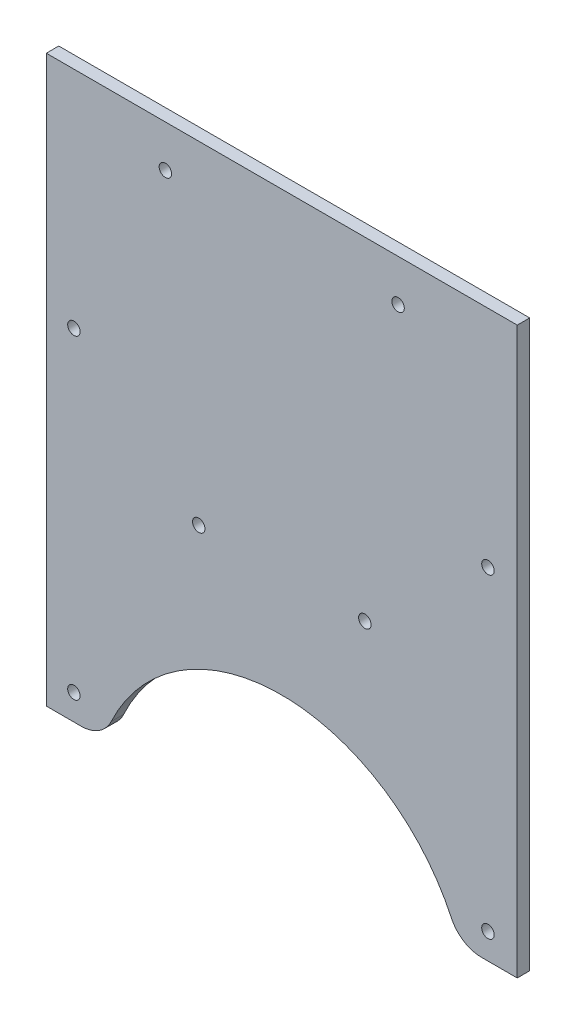
ISO-10303-21;
HEADER;
FILE_DESCRIPTION(('STEP AP214'),'2;1');
FILE_NAME('part.step','',(''),(''),'','','');
FILE_SCHEMA(('AUTOMOTIVE_DESIGN { 1 0 10303 214 1 1 1 1 }'));
ENDSEC;
DATA;
#1=APPLICATION_CONTEXT('core data for automotive mechanical design processes');
#2=APPLICATION_PROTOCOL_DEFINITION('international standard','automotive_design',2000,#1);
#3=PRODUCT_CONTEXT('',#1,'mechanical');
#4=PRODUCT('Part','Part','',(#3));
#5=PRODUCT_RELATED_PRODUCT_CATEGORY('part','',(#4));
#6=PRODUCT_DEFINITION_FORMATION('','',#4);
#7=PRODUCT_DEFINITION_CONTEXT('part definition',#1,'design');
#8=PRODUCT_DEFINITION('design','',#6,#7);
#9=PRODUCT_DEFINITION_SHAPE('','',#8);
#10=(LENGTH_UNIT() NAMED_UNIT(*) SI_UNIT(.MILLI.,.METRE.));
#11=(NAMED_UNIT(*) PLANE_ANGLE_UNIT() SI_UNIT($,.RADIAN.));
#12=(NAMED_UNIT(*) SI_UNIT($,.STERADIAN.) SOLID_ANGLE_UNIT());
#13=UNCERTAINTY_MEASURE_WITH_UNIT(LENGTH_MEASURE(1.E-05),#10,'distance_accuracy_value','');
#14=(GEOMETRIC_REPRESENTATION_CONTEXT(3) GLOBAL_UNCERTAINTY_ASSIGNED_CONTEXT((#13)) GLOBAL_UNIT_ASSIGNED_CONTEXT((#10,
#11,#12)) REPRESENTATION_CONTEXT('',''));
#15=CARTESIAN_POINT('',(0.,0.,0.));
#16=DIRECTION('',(0.,0.,1.));
#17=DIRECTION('',(1.,0.,0.));
#18=AXIS2_PLACEMENT_3D('',#15,#16,#17);
#19=CARTESIAN_POINT('',(113.4,43.846327588839,-7.));
#20=DIRECTION('',(0.,1.,0.));
#21=DIRECTION('',(0.,0.,1.));
#22=AXIS2_PLACEMENT_3D('',#19,#20,#21);
#23=PLANE('',#22);
#24=DIRECTION('',(1.,0.,0.));
#25=VECTOR('',#24,1.);
#26=CARTESIAN_POINT('',(0.,43.846327588839,0.));
#27=LINE('',#26,#25);
#28=CARTESIAN_POINT('',(0.,43.846327588839,0.));
#29=VERTEX_POINT('',#28);
#30=CARTESIAN_POINT('',(8.38958934600654,43.846327588839,0.));
#31=VERTEX_POINT('',#30);
#32=EDGE_CURVE('E173',#29,#31,#27,.T.);
#33=ORIENTED_EDGE('',*,*,#32,.T.);
#34=DIRECTION('',(0.,0.,1.));
#35=VECTOR('',#34,1.);
#36=CARTESIAN_POINT('',(8.38958934600655,43.846327588839,-7.));
#37=LINE('',#36,#35);
#38=CARTESIAN_POINT('',(8.38958934600655,43.846327588839,3.));
#39=VERTEX_POINT('',#38);
#40=EDGE_CURVE('E176',#31,#39,#37,.T.);
#41=ORIENTED_EDGE('',*,*,#40,.T.);
#42=DIRECTION('',(-1.,0.,0.));
#43=VECTOR('',#42,1.);
#44=CARTESIAN_POINT('',(113.4,43.846327588839,3.));
#45=LINE('',#44,#43);
#46=CARTESIAN_POINT('',(0.,43.846327588839,3.));
#47=VERTEX_POINT('',#46);
#48=EDGE_CURVE('E121',#39,#47,#45,.T.);
#49=ORIENTED_EDGE('',*,*,#48,.T.);
#50=DIRECTION('',(0.,0.,1.));
#51=VECTOR('',#50,1.);
#52=CARTESIAN_POINT('',(0.,43.846327588839,3.));
#53=LINE('',#52,#51);
#54=EDGE_CURVE('E111',#29,#47,#53,.T.);
#55=ORIENTED_EDGE('',*,*,#54,.F.);
#56=EDGE_LOOP('',(#33,#41,#49,#55));
#57=FACE_BOUND('',#56,.T.);
#58=ADVANCED_FACE('F38',(#57),#23,.F.);
#59=CARTESIAN_POINT('',(0.,0.,3.));
#60=DIRECTION('',(1.,0.,0.));
#61=DIRECTION('',(0.,1.,0.));
#62=AXIS2_PLACEMENT_3D('',#59,#60,#61);
#63=PLANE('',#62);
#64=DIRECTION('',(0.,-1.,0.));
#65=VECTOR('',#64,1.);
#66=CARTESIAN_POINT('',(0.,0.,0.));
#67=LINE('',#66,#65);
#68=CARTESIAN_POINT('',(0.,180.,0.));
#69=VERTEX_POINT('',#68);
#70=EDGE_CURVE('E137',#69,#29,#67,.T.);
#71=ORIENTED_EDGE('',*,*,#70,.T.);
#72=ORIENTED_EDGE('',*,*,#54,.T.);
#73=DIRECTION('',(0.,-1.,0.));
#74=VECTOR('',#73,1.);
#75=CARTESIAN_POINT('',(0.,0.,3.));
#76=LINE('',#75,#74);
#77=CARTESIAN_POINT('',(0.,180.,3.));
#78=VERTEX_POINT('',#77);
#79=EDGE_CURVE('E128',#78,#47,#76,.T.);
#80=ORIENTED_EDGE('',*,*,#79,.F.);
#81=DIRECTION('',(0.,0.,-1.));
#82=VECTOR('',#81,1.);
#83=CARTESIAN_POINT('',(0.,180.,3.));
#84=LINE('',#83,#82);
#85=EDGE_CURVE('E130',#78,#69,#84,.T.);
#86=ORIENTED_EDGE('',*,*,#85,.T.);
#87=EDGE_LOOP('',(#71,#72,#80,#86));
#88=FACE_BOUND('',#87,.T.);
#89=ADVANCED_FACE('F245',(#88),#63,.F.);
#90=CARTESIAN_POINT('',(113.4,0.,3.));
#91=DIRECTION('',(-1.,0.,0.));
#92=DIRECTION('',(0.,-1.,0.));
#93=AXIS2_PLACEMENT_3D('',#90,#91,#92);
#94=PLANE('',#93);
#95=DIRECTION('',(0.,1.,0.));
#96=VECTOR('',#95,1.);
#97=CARTESIAN_POINT('',(113.4,0.,3.));
#98=LINE('',#97,#96);
#99=CARTESIAN_POINT('',(113.4,43.846327588839,3.));
#100=VERTEX_POINT('',#99);
#101=CARTESIAN_POINT('',(113.4,180.,3.));
#102=VERTEX_POINT('',#101);
#103=EDGE_CURVE('E116',#100,#102,#98,.T.);
#104=ORIENTED_EDGE('',*,*,#103,.F.);
#105=DIRECTION('',(0.,0.,1.));
#106=VECTOR('',#105,1.);
#107=CARTESIAN_POINT('',(113.4,43.846327588839,-7.));
#108=LINE('',#107,#106);
#109=CARTESIAN_POINT('',(113.4,43.846327588839,0.));
#110=VERTEX_POINT('',#109);
#111=EDGE_CURVE('E103',#110,#100,#108,.T.);
#112=ORIENTED_EDGE('',*,*,#111,.F.);
#113=DIRECTION('',(0.,1.,0.));
#114=VECTOR('',#113,1.);
#115=CARTESIAN_POINT('',(113.4,0.,0.));
#116=LINE('',#115,#114);
#117=CARTESIAN_POINT('',(113.4,180.,0.));
#118=VERTEX_POINT('',#117);
#119=EDGE_CURVE('E140',#110,#118,#116,.T.);
#120=ORIENTED_EDGE('',*,*,#119,.T.);
#121=DIRECTION('',(0.,0.,-1.));
#122=VECTOR('',#121,1.);
#123=CARTESIAN_POINT('',(113.4,180.,3.));
#124=LINE('',#123,#122);
#125=EDGE_CURVE('E125',#102,#118,#124,.T.);
#126=ORIENTED_EDGE('',*,*,#125,.F.);
#127=EDGE_LOOP('',(#104,#112,#120,#126));
#128=FACE_BOUND('',#127,.T.);
#129=ADVANCED_FACE('F123',(#128),#94,.F.);
#130=CARTESIAN_POINT('',(0.,180.,3.));
#131=DIRECTION('',(0.,-1.,0.));
#132=DIRECTION('',(0.,0.,-1.));
#133=AXIS2_PLACEMENT_3D('',#130,#131,#132);
#134=PLANE('',#133);
#135=DIRECTION('',(-1.,0.,0.));
#136=VECTOR('',#135,1.);
#137=CARTESIAN_POINT('',(0.,180.,0.));
#138=LINE('',#137,#136);
#139=EDGE_CURVE('E133',#118,#69,#138,.T.);
#140=ORIENTED_EDGE('',*,*,#139,.T.);
#141=ORIENTED_EDGE('',*,*,#85,.F.);
#142=DIRECTION('',(-1.,0.,0.));
#143=VECTOR('',#142,1.);
#144=CARTESIAN_POINT('',(0.,180.,3.));
#145=LINE('',#144,#143);
#146=EDGE_CURVE('E127',#102,#78,#145,.T.);
#147=ORIENTED_EDGE('',*,*,#146,.F.);
#148=ORIENTED_EDGE('',*,*,#125,.T.);
#149=EDGE_LOOP('',(#140,#141,#147,#148));
#150=FACE_BOUND('',#149,.T.);
#151=ADVANCED_FACE('F230',(#150),#134,.F.);
#152=CARTESIAN_POINT('',(0.,0.,3.));
#153=DIRECTION('',(0.,0.,-1.));
#154=DIRECTION('',(-1.,0.,0.));
#155=AXIS2_PLACEMENT_3D('',#152,#153,#154);
#156=PLANE('',#155);
#157=CARTESIAN_POINT('',(28.6759127752915,169.916374803463,3.));
#158=DIRECTION('',(0.,0.,1.));
#159=DIRECTION('',(1.,0.,0.));
#160=AXIS2_PLACEMENT_3D('',#157,#158,#159);
#161=CIRCLE('',#160,1.5);
#162=CARTESIAN_POINT('',(30.1759127752916,169.916374803463,3.));
#163=VERTEX_POINT('',#162);
#164=EDGE_CURVE('E206',#163,#163,#161,.T.);
#165=ORIENTED_EDGE('',*,*,#164,.F.);
#166=EDGE_LOOP('',(#165));
#167=FACE_BOUND('',#166,.T.);
#168=CARTESIAN_POINT('',(84.7062318964248,169.916374803463,3.));
#169=DIRECTION('',(0.,0.,1.));
#170=DIRECTION('',(1.,0.,0.));
#171=AXIS2_PLACEMENT_3D('',#168,#169,#170);
#172=CIRCLE('',#171,1.5);
#173=CARTESIAN_POINT('',(86.2062318964248,169.916374803463,3.));
#174=VERTEX_POINT('',#173);
#175=EDGE_CURVE('E210',#174,#174,#172,.T.);
#176=ORIENTED_EDGE('',*,*,#175,.F.);
#177=EDGE_LOOP('',(#176));
#178=FACE_BOUND('',#177,.T.);
#179=CARTESIAN_POINT('',(36.7062318964249,99.916374803463,3.));
#180=DIRECTION('',(0.,0.,1.));
#181=DIRECTION('',(1.,0.,0.));
#182=AXIS2_PLACEMENT_3D('',#179,#180,#181);
#183=CIRCLE('',#182,1.49999999999999);
#184=CARTESIAN_POINT('',(38.2062318964249,99.916374803463,3.));
#185=VERTEX_POINT('',#184);
#186=EDGE_CURVE('E207',#185,#185,#183,.T.);
#187=ORIENTED_EDGE('',*,*,#186,.F.);
#188=EDGE_LOOP('',(#187));
#189=FACE_BOUND('',#188,.T.);
#190=CARTESIAN_POINT('',(76.7062318964249,99.9163748034631,3.));
#191=DIRECTION('',(0.,0.,1.));
#192=DIRECTION('',(1.,0.,0.));
#193=AXIS2_PLACEMENT_3D('',#190,#191,#192);
#194=CIRCLE('',#193,1.49999999999998);
#195=CARTESIAN_POINT('',(78.2062318964249,99.9163748034631,3.));
#196=VERTEX_POINT('',#195);
#197=EDGE_CURVE('E163',#196,#196,#194,.T.);
#198=ORIENTED_EDGE('',*,*,#197,.F.);
#199=EDGE_LOOP('',(#198));
#200=FACE_BOUND('',#199,.T.);
#201=CARTESIAN_POINT('',(106.346648171062,125.962542605571,3.));
#202=DIRECTION('',(0.,0.,1.));
#203=DIRECTION('',(1.,0.,0.));
#204=AXIS2_PLACEMENT_3D('',#201,#202,#203);
#205=CIRCLE('',#204,1.5);
#206=CARTESIAN_POINT('',(107.846648171062,125.962542605571,3.));
#207=VERTEX_POINT('',#206);
#208=EDGE_CURVE('E172',#207,#207,#205,.T.);
#209=ORIENTED_EDGE('',*,*,#208,.F.);
#210=EDGE_LOOP('',(#209));
#211=FACE_BOUND('',#210,.T.);
#212=CARTESIAN_POINT('',(6.64737057232823,125.962542605571,3.));
#213=DIRECTION('',(0.,0.,1.));
#214=DIRECTION('',(1.,0.,0.));
#215=AXIS2_PLACEMENT_3D('',#212,#213,#214);
#216=CIRCLE('',#215,1.5);
#217=CARTESIAN_POINT('',(8.14737057232822,125.962542605571,3.));
#218=VERTEX_POINT('',#217);
#219=EDGE_CURVE('E220',#218,#218,#216,.T.);
#220=ORIENTED_EDGE('',*,*,#219,.F.);
#221=EDGE_LOOP('',(#220));
#222=FACE_BOUND('',#221,.T.);
#223=CARTESIAN_POINT('',(6.64737057232823,50.0374573944294,3.));
#224=DIRECTION('',(0.,0.,1.));
#225=DIRECTION('',(1.,0.,0.));
#226=AXIS2_PLACEMENT_3D('',#223,#224,#225);
#227=CIRCLE('',#226,1.5);
#228=CARTESIAN_POINT('',(8.14737057232823,50.0374573944294,3.));
#229=VERTEX_POINT('',#228);
#230=EDGE_CURVE('E217',#229,#229,#227,.T.);
#231=ORIENTED_EDGE('',*,*,#230,.F.);
#232=EDGE_LOOP('',(#231));
#233=FACE_BOUND('',#232,.T.);
#234=CARTESIAN_POINT('',(106.346648171062,50.0374573944294,3.));
#235=DIRECTION('',(0.,0.,1.));
#236=DIRECTION('',(1.,0.,0.));
#237=AXIS2_PLACEMENT_3D('',#234,#235,#236);
#238=CIRCLE('',#237,1.5);
#239=CARTESIAN_POINT('',(107.846648171062,50.0374573944294,3.));
#240=VERTEX_POINT('',#239);
#241=EDGE_CURVE('E151',#240,#240,#238,.T.);
#242=ORIENTED_EDGE('',*,*,#241,.F.);
#243=EDGE_LOOP('',(#242));
#244=FACE_BOUND('',#243,.T.);
#245=ORIENTED_EDGE('',*,*,#48,.F.);
#246=CARTESIAN_POINT('',(8.38958934600654,51.846327588839,3.));
#247=DIRECTION('',(0.,0.,-1.));
#248=DIRECTION('',(-1.,0.,0.));
#249=AXIS2_PLACEMENT_3D('',#246,#247,#248);
#250=CIRCLE('',#249,8.);
#251=CARTESIAN_POINT('',(15.6355816176395,48.4558119939131,3.));
#252=VERTEX_POINT('',#251);
#253=EDGE_CURVE('E180',#39,#252,#250,.F.);
#254=ORIENTED_EDGE('',*,*,#253,.T.);
#255=CARTESIAN_POINT('',(56.5872890314485,29.2938535732658,3.));
#256=DIRECTION('',(0.,0.,1.));
#257=DIRECTION('',(1.,0.,0.));
#258=AXIS2_PLACEMENT_3D('',#255,#256,#257);
#259=CIRCLE('',#258,45.213084285645);
#260=CARTESIAN_POINT('',(97.5389964452575,48.4558119939131,3.));
#261=VERTEX_POINT('',#260);
#262=EDGE_CURVE('E199',#261,#252,#259,.T.);
#263=ORIENTED_EDGE('',*,*,#262,.F.);
#264=CARTESIAN_POINT('',(104.78498871689,51.846327588839,3.));
#265=DIRECTION('',(0.,0.,-1.));
#266=DIRECTION('',(-1.,0.,0.));
#267=AXIS2_PLACEMENT_3D('',#264,#265,#266);
#268=CIRCLE('',#267,8.);
#269=CARTESIAN_POINT('',(104.78498871689,43.846327588839,3.));
#270=VERTEX_POINT('',#269);
#271=EDGE_CURVE('E120',#261,#270,#268,.F.);
#272=ORIENTED_EDGE('',*,*,#271,.T.);
#273=EDGE_CURVE('E106',#100,#270,#45,.T.);
#274=ORIENTED_EDGE('',*,*,#273,.F.);
#275=ORIENTED_EDGE('',*,*,#103,.T.);
#276=ORIENTED_EDGE('',*,*,#146,.T.);
#277=ORIENTED_EDGE('',*,*,#79,.T.);
#278=EDGE_LOOP('',(#245,#254,#263,#272,#274,#275,#276,#277));
#279=FACE_BOUND('',#278,.T.);
#280=ADVANCED_FACE('F115',(#167,#178,#189,#200,#211,#222,#233,#244,#279),#156,.F.);
#281=CARTESIAN_POINT('',(0.,0.,0.));
#282=DIRECTION('',(0.,0.,-1.));
#283=DIRECTION('',(-1.,0.,0.));
#284=AXIS2_PLACEMENT_3D('',#281,#282,#283);
#285=PLANE('',#284);
#286=CARTESIAN_POINT('',(56.5872890314485,29.2938535732658,0.));
#287=DIRECTION('',(0.,0.,-1.));
#288=DIRECTION('',(-1.,0.,0.));
#289=AXIS2_PLACEMENT_3D('',#286,#287,#288);
#290=CIRCLE('',#289,45.213084285645);
#291=CARTESIAN_POINT('',(15.6355816176395,48.4558119939131,0.));
#292=VERTEX_POINT('',#291);
#293=CARTESIAN_POINT('',(97.5389964452575,48.4558119939131,0.));
#294=VERTEX_POINT('',#293);
#295=EDGE_CURVE('E191',#292,#294,#290,.T.);
#296=ORIENTED_EDGE('',*,*,#295,.F.);
#297=CARTESIAN_POINT('',(8.38958934600654,51.846327588839,0.));
#298=DIRECTION('',(0.,0.,-1.));
#299=DIRECTION('',(-1.,0.,0.));
#300=AXIS2_PLACEMENT_3D('',#297,#298,#299);
#301=CIRCLE('',#300,8.);
#302=EDGE_CURVE('E46',#292,#31,#301,.T.);
#303=ORIENTED_EDGE('',*,*,#302,.T.);
#304=ORIENTED_EDGE('',*,*,#32,.F.);
#305=ORIENTED_EDGE('',*,*,#70,.F.);
#306=ORIENTED_EDGE('',*,*,#139,.F.);
#307=ORIENTED_EDGE('',*,*,#119,.F.);
#308=CARTESIAN_POINT('',(104.78498871689,43.846327588839,0.));
#309=VERTEX_POINT('',#308);
#310=EDGE_CURVE('E107',#309,#110,#27,.T.);
#311=ORIENTED_EDGE('',*,*,#310,.F.);
#312=CARTESIAN_POINT('',(104.78498871689,51.846327588839,0.));
#313=DIRECTION('',(0.,0.,-1.));
#314=DIRECTION('',(-1.,0.,0.));
#315=AXIS2_PLACEMENT_3D('',#312,#313,#314);
#316=CIRCLE('',#315,8.);
#317=EDGE_CURVE('E53',#309,#294,#316,.T.);
#318=ORIENTED_EDGE('',*,*,#317,.T.);
#319=EDGE_LOOP('',(#296,#303,#304,#305,#306,#307,#311,#318));
#320=FACE_BOUND('',#319,.T.);
#321=CARTESIAN_POINT('',(28.6759127752915,169.916374803463,0.));
#322=DIRECTION('',(0.,0.,-1.));
#323=DIRECTION('',(-1.,0.,0.));
#324=AXIS2_PLACEMENT_3D('',#321,#322,#323);
#325=CIRCLE('',#324,1.5);
#326=CARTESIAN_POINT('',(27.1759127752915,169.916374803463,0.));
#327=VERTEX_POINT('',#326);
#328=EDGE_CURVE('E169',#327,#327,#325,.T.);
#329=ORIENTED_EDGE('',*,*,#328,.F.);
#330=EDGE_LOOP('',(#329));
#331=FACE_BOUND('',#330,.T.);
#332=CARTESIAN_POINT('',(84.7062318964248,169.916374803463,0.));
#333=DIRECTION('',(0.,0.,-1.));
#334=DIRECTION('',(-1.,0.,0.));
#335=AXIS2_PLACEMENT_3D('',#332,#333,#334);
#336=CIRCLE('',#335,1.5);
#337=CARTESIAN_POINT('',(83.2062318964248,169.916374803463,0.));
#338=VERTEX_POINT('',#337);
#339=EDGE_CURVE('E166',#338,#338,#336,.T.);
#340=ORIENTED_EDGE('',*,*,#339,.F.);
#341=EDGE_LOOP('',(#340));
#342=FACE_BOUND('',#341,.T.);
#343=CARTESIAN_POINT('',(36.7062318964249,99.916374803463,0.));
#344=DIRECTION('',(0.,0.,-1.));
#345=DIRECTION('',(-1.,0.,0.));
#346=AXIS2_PLACEMENT_3D('',#343,#344,#345);
#347=CIRCLE('',#346,1.49999999999999);
#348=CARTESIAN_POINT('',(35.2062318964249,99.916374803463,0.));
#349=VERTEX_POINT('',#348);
#350=EDGE_CURVE('E162',#349,#349,#347,.T.);
#351=ORIENTED_EDGE('',*,*,#350,.F.);
#352=EDGE_LOOP('',(#351));
#353=FACE_BOUND('',#352,.T.);
#354=CARTESIAN_POINT('',(76.7062318964249,99.9163748034631,0.));
#355=DIRECTION('',(0.,0.,-1.));
#356=DIRECTION('',(-1.,0.,0.));
#357=AXIS2_PLACEMENT_3D('',#354,#355,#356);
#358=CIRCLE('',#357,1.49999999999998);
#359=CARTESIAN_POINT('',(75.2062318964249,99.9163748034631,0.));
#360=VERTEX_POINT('',#359);
#361=EDGE_CURVE('E159',#360,#360,#358,.T.);
#362=ORIENTED_EDGE('',*,*,#361,.F.);
#363=EDGE_LOOP('',(#362));
#364=FACE_BOUND('',#363,.T.);
#365=CARTESIAN_POINT('',(106.346648171062,125.962542605571,0.));
#366=DIRECTION('',(0.,0.,-1.));
#367=DIRECTION('',(-1.,0.,0.));
#368=AXIS2_PLACEMENT_3D('',#365,#366,#367);
#369=CIRCLE('',#368,1.5);
#370=CARTESIAN_POINT('',(104.846648171062,125.962542605571,0.));
#371=VERTEX_POINT('',#370);
#372=EDGE_CURVE('E141',#371,#371,#369,.T.);
#373=ORIENTED_EDGE('',*,*,#372,.F.);
#374=EDGE_LOOP('',(#373));
#375=FACE_BOUND('',#374,.T.);
#376=CARTESIAN_POINT('',(6.64737057232823,125.962542605571,0.));
#377=DIRECTION('',(0.,0.,-1.));
#378=DIRECTION('',(-1.,0.,0.));
#379=AXIS2_PLACEMENT_3D('',#376,#377,#378);
#380=CIRCLE('',#379,1.5);
#381=CARTESIAN_POINT('',(5.14737057232823,125.962542605571,0.));
#382=VERTEX_POINT('',#381);
#383=EDGE_CURVE('E154',#382,#382,#380,.T.);
#384=ORIENTED_EDGE('',*,*,#383,.F.);
#385=EDGE_LOOP('',(#384));
#386=FACE_BOUND('',#385,.T.);
#387=CARTESIAN_POINT('',(6.64737057232823,50.0374573944294,0.));
#388=DIRECTION('',(0.,0.,-1.));
#389=DIRECTION('',(-1.,0.,0.));
#390=AXIS2_PLACEMENT_3D('',#387,#388,#389);
#391=CIRCLE('',#390,1.5);
#392=CARTESIAN_POINT('',(5.14737057232823,50.0374573944294,0.));
#393=VERTEX_POINT('',#392);
#394=EDGE_CURVE('E150',#393,#393,#391,.T.);
#395=ORIENTED_EDGE('',*,*,#394,.F.);
#396=EDGE_LOOP('',(#395));
#397=FACE_BOUND('',#396,.T.);
#398=CARTESIAN_POINT('',(106.346648171062,50.0374573944294,0.));
#399=DIRECTION('',(0.,0.,-1.));
#400=DIRECTION('',(-1.,0.,0.));
#401=AXIS2_PLACEMENT_3D('',#398,#399,#400);
#402=CIRCLE('',#401,1.5);
#403=CARTESIAN_POINT('',(104.846648171062,50.0374573944294,0.));
#404=VERTEX_POINT('',#403);
#405=EDGE_CURVE('E147',#404,#404,#402,.T.);
#406=ORIENTED_EDGE('',*,*,#405,.F.);
#407=EDGE_LOOP('',(#406));
#408=FACE_BOUND('',#407,.T.);
#409=ADVANCED_FACE('F188',(#320,#331,#342,#353,#364,#375,#386,#397,#408),#285,.T.);
#410=CARTESIAN_POINT('',(106.346648171062,50.0374573944294,-7.));
#411=DIRECTION('',(0.,0.,1.));
#412=DIRECTION('',(1.,0.,0.));
#413=AXIS2_PLACEMENT_3D('',#410,#411,#412);
#414=CYLINDRICAL_SURFACE('',#413,1.5);
#415=ORIENTED_EDGE('',*,*,#405,.T.);
#416=EDGE_LOOP('',(#415));
#417=FACE_BOUND('',#416,.T.);
#418=ORIENTED_EDGE('',*,*,#241,.T.);
#419=EDGE_LOOP('',(#418));
#420=FACE_BOUND('',#419,.T.);
#421=ADVANCED_FACE('F227',(#417,#420),#414,.F.);
#422=CARTESIAN_POINT('',(6.64737057232823,50.0374573944294,-7.));
#423=DIRECTION('',(0.,0.,1.));
#424=DIRECTION('',(1.,0.,0.));
#425=AXIS2_PLACEMENT_3D('',#422,#423,#424);
#426=CYLINDRICAL_SURFACE('',#425,1.5);
#427=ORIENTED_EDGE('',*,*,#394,.T.);
#428=EDGE_LOOP('',(#427));
#429=FACE_BOUND('',#428,.T.);
#430=ORIENTED_EDGE('',*,*,#230,.T.);
#431=EDGE_LOOP('',(#430));
#432=FACE_BOUND('',#431,.T.);
#433=ADVANCED_FACE('F277',(#429,#432),#426,.F.);
#434=CARTESIAN_POINT('',(6.64737057232823,125.962542605571,-7.));
#435=DIRECTION('',(0.,0.,1.));
#436=DIRECTION('',(1.,0.,0.));
#437=AXIS2_PLACEMENT_3D('',#434,#435,#436);
#438=CYLINDRICAL_SURFACE('',#437,1.5);
#439=ORIENTED_EDGE('',*,*,#383,.T.);
#440=EDGE_LOOP('',(#439));
#441=FACE_BOUND('',#440,.T.);
#442=ORIENTED_EDGE('',*,*,#219,.T.);
#443=EDGE_LOOP('',(#442));
#444=FACE_BOUND('',#443,.T.);
#445=ADVANCED_FACE('F280',(#441,#444),#438,.F.);
#446=CARTESIAN_POINT('',(106.346648171062,125.962542605571,-7.));
#447=DIRECTION('',(0.,0.,1.));
#448=DIRECTION('',(1.,0.,0.));
#449=AXIS2_PLACEMENT_3D('',#446,#447,#448);
#450=CYLINDRICAL_SURFACE('',#449,1.5);
#451=ORIENTED_EDGE('',*,*,#372,.T.);
#452=EDGE_LOOP('',(#451));
#453=FACE_BOUND('',#452,.T.);
#454=ORIENTED_EDGE('',*,*,#208,.T.);
#455=EDGE_LOOP('',(#454));
#456=FACE_BOUND('',#455,.T.);
#457=ADVANCED_FACE('F275',(#453,#456),#450,.F.);
#458=CARTESIAN_POINT('',(76.7062318964249,99.9163748034631,-7.));
#459=DIRECTION('',(0.,0.,1.));
#460=DIRECTION('',(1.,0.,0.));
#461=AXIS2_PLACEMENT_3D('',#458,#459,#460);
#462=CYLINDRICAL_SURFACE('',#461,1.49999999999998);
#463=ORIENTED_EDGE('',*,*,#361,.T.);
#464=EDGE_LOOP('',(#463));
#465=FACE_BOUND('',#464,.T.);
#466=ORIENTED_EDGE('',*,*,#197,.T.);
#467=EDGE_LOOP('',(#466));
#468=FACE_BOUND('',#467,.T.);
#469=ADVANCED_FACE('F272',(#465,#468),#462,.F.);
#470=CARTESIAN_POINT('',(36.7062318964249,99.916374803463,-7.));
#471=DIRECTION('',(0.,0.,1.));
#472=DIRECTION('',(1.,0.,0.));
#473=AXIS2_PLACEMENT_3D('',#470,#471,#472);
#474=CYLINDRICAL_SURFACE('',#473,1.49999999999999);
#475=ORIENTED_EDGE('',*,*,#350,.T.);
#476=EDGE_LOOP('',(#475));
#477=FACE_BOUND('',#476,.T.);
#478=ORIENTED_EDGE('',*,*,#186,.T.);
#479=EDGE_LOOP('',(#478));
#480=FACE_BOUND('',#479,.T.);
#481=ADVANCED_FACE('F267',(#477,#480),#474,.F.);
#482=CARTESIAN_POINT('',(84.7062318964248,169.916374803463,-7.));
#483=DIRECTION('',(0.,0.,1.));
#484=DIRECTION('',(1.,0.,0.));
#485=AXIS2_PLACEMENT_3D('',#482,#483,#484);
#486=CYLINDRICAL_SURFACE('',#485,1.5);
#487=ORIENTED_EDGE('',*,*,#339,.T.);
#488=EDGE_LOOP('',(#487));
#489=FACE_BOUND('',#488,.T.);
#490=ORIENTED_EDGE('',*,*,#175,.T.);
#491=EDGE_LOOP('',(#490));
#492=FACE_BOUND('',#491,.T.);
#493=ADVANCED_FACE('F261',(#489,#492),#486,.F.);
#494=CARTESIAN_POINT('',(28.6759127752915,169.916374803463,-7.));
#495=DIRECTION('',(0.,0.,1.));
#496=DIRECTION('',(1.,0.,0.));
#497=AXIS2_PLACEMENT_3D('',#494,#495,#496);
#498=CYLINDRICAL_SURFACE('',#497,1.5);
#499=ORIENTED_EDGE('',*,*,#328,.T.);
#500=EDGE_LOOP('',(#499));
#501=FACE_BOUND('',#500,.T.);
#502=ORIENTED_EDGE('',*,*,#164,.T.);
#503=EDGE_LOOP('',(#502));
#504=FACE_BOUND('',#503,.T.);
#505=ADVANCED_FACE('F256',(#501,#504),#498,.F.);
#506=ORIENTED_EDGE('',*,*,#273,.T.);
#507=DIRECTION('',(0.,0.,1.));
#508=VECTOR('',#507,1.);
#509=CARTESIAN_POINT('',(104.78498871689,43.846327588839,-7.));
#510=LINE('',#509,#508);
#511=EDGE_CURVE('E11',#270,#309,#510,.F.);
#512=ORIENTED_EDGE('',*,*,#511,.T.);
#513=ORIENTED_EDGE('',*,*,#310,.T.);
#514=ORIENTED_EDGE('',*,*,#111,.T.);
#515=EDGE_LOOP('',(#506,#512,#513,#514));
#516=FACE_BOUND('',#515,.T.);
#517=ADVANCED_FACE('F105',(#516),#23,.F.);
#518=CARTESIAN_POINT('',(56.5872890314485,29.2938535732658,-7.));
#519=DIRECTION('',(0.,0.,1.));
#520=DIRECTION('',(1.,0.,0.));
#521=AXIS2_PLACEMENT_3D('',#518,#519,#520);
#522=CYLINDRICAL_SURFACE('',#521,45.213084285645);
#523=ORIENTED_EDGE('',*,*,#262,.T.);
#524=DIRECTION('',(0.,0.,1.));
#525=VECTOR('',#524,1.);
#526=CARTESIAN_POINT('',(15.6355816176395,48.4558119939131,-7.));
#527=LINE('',#526,#525);
#528=EDGE_CURVE('E184',#252,#292,#527,.F.);
#529=ORIENTED_EDGE('',*,*,#528,.T.);
#530=ORIENTED_EDGE('',*,*,#295,.T.);
#531=DIRECTION('',(0.,0.,1.));
#532=VECTOR('',#531,1.);
#533=CARTESIAN_POINT('',(97.5389964452575,48.4558119939131,-7.));
#534=LINE('',#533,#532);
#535=EDGE_CURVE('E182',#294,#261,#534,.T.);
#536=ORIENTED_EDGE('',*,*,#535,.T.);
#537=EDGE_LOOP('',(#523,#529,#530,#536));
#538=FACE_BOUND('',#537,.T.);
#539=ADVANCED_FACE('F201',(#538),#522,.F.);
#540=CARTESIAN_POINT('',(8.38958934600654,51.846327588839,-7.));
#541=DIRECTION('',(0.,0.,1.));
#542=DIRECTION('',(1.,0.,0.));
#543=AXIS2_PLACEMENT_3D('',#540,#541,#542);
#544=CYLINDRICAL_SURFACE('',#543,8.);
#545=ORIENTED_EDGE('',*,*,#302,.F.);
#546=ORIENTED_EDGE('',*,*,#528,.F.);
#547=ORIENTED_EDGE('',*,*,#253,.F.);
#548=ORIENTED_EDGE('',*,*,#40,.F.);
#549=EDGE_LOOP('',(#545,#546,#547,#548));
#550=FACE_BOUND('',#549,.T.);
#551=ADVANCED_FACE('F197',(#550),#544,.T.);
#552=CARTESIAN_POINT('',(104.78498871689,51.846327588839,-7.));
#553=DIRECTION('',(0.,0.,1.));
#554=DIRECTION('',(1.,0.,0.));
#555=AXIS2_PLACEMENT_3D('',#552,#553,#554);
#556=CYLINDRICAL_SURFACE('',#555,8.);
#557=ORIENTED_EDGE('',*,*,#271,.F.);
#558=ORIENTED_EDGE('',*,*,#535,.F.);
#559=ORIENTED_EDGE('',*,*,#317,.F.);
#560=ORIENTED_EDGE('',*,*,#511,.F.);
#561=EDGE_LOOP('',(#557,#558,#559,#560));
#562=FACE_BOUND('',#561,.T.);
#563=ADVANCED_FACE('F40',(#562),#556,.T.);
#564=CLOSED_SHELL('',(#58,#89,#129,#151,#280,#409,#421,#433,#445,#457,#469,#481,#493,#505,#517,
#539,#551,#563));
#565=MANIFOLD_SOLID_BREP('B2',#564);
#566=ADVANCED_BREP_SHAPE_REPRESENTATION('',(#18,#565),#14);
#567=SHAPE_DEFINITION_REPRESENTATION(#9,#566);
ENDSEC;
END-ISO-10303-21;
